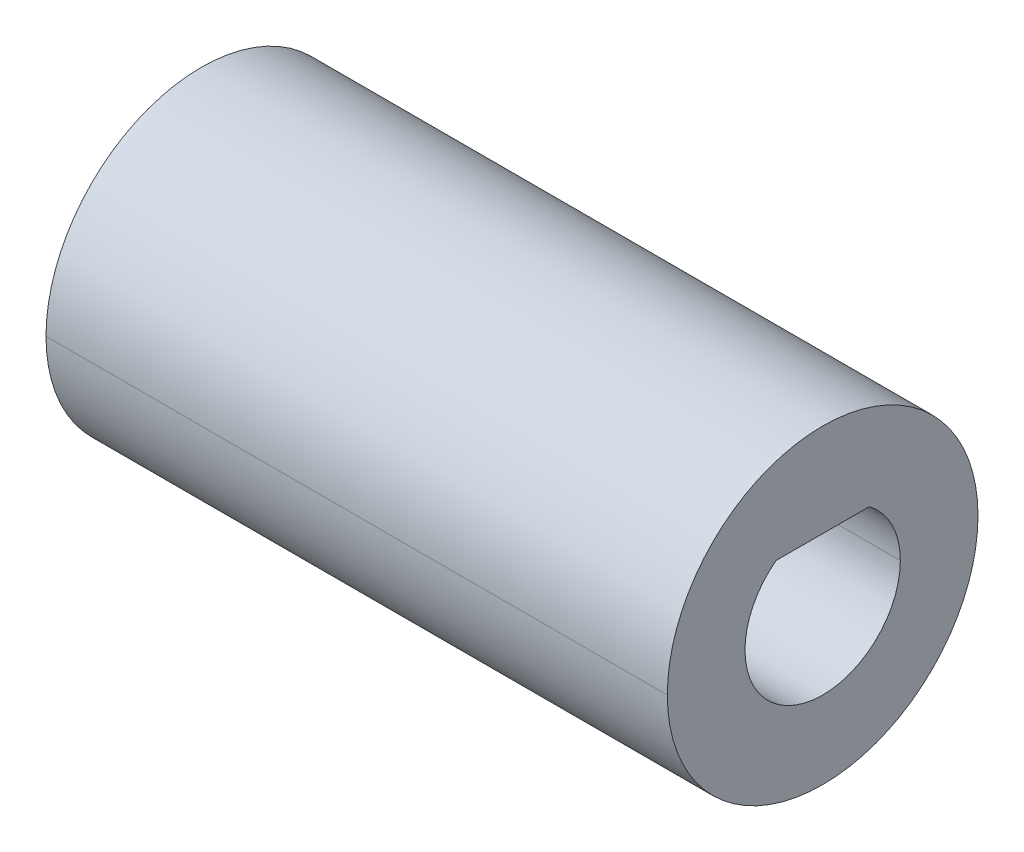
ISO-10303-21;
HEADER;
FILE_DESCRIPTION(('STEP AP214'),'2;1');
FILE_NAME('part.step','',(''),(''),'','','');
FILE_SCHEMA(('AUTOMOTIVE_DESIGN { 1 0 10303 214 1 1 1 1 }'));
ENDSEC;
DATA;
#1=APPLICATION_CONTEXT('core data for automotive mechanical design processes');
#2=APPLICATION_PROTOCOL_DEFINITION('international standard','automotive_design',2000,#1);
#3=PRODUCT_CONTEXT('',#1,'mechanical');
#4=PRODUCT('Part','Part','',(#3));
#5=PRODUCT_RELATED_PRODUCT_CATEGORY('part','',(#4));
#6=PRODUCT_DEFINITION_FORMATION('','',#4);
#7=PRODUCT_DEFINITION_CONTEXT('part definition',#1,'design');
#8=PRODUCT_DEFINITION('design','',#6,#7);
#9=PRODUCT_DEFINITION_SHAPE('','',#8);
#10=(LENGTH_UNIT() NAMED_UNIT(*) SI_UNIT(.MILLI.,.METRE.));
#11=(NAMED_UNIT(*) PLANE_ANGLE_UNIT() SI_UNIT($,.RADIAN.));
#12=(NAMED_UNIT(*) SI_UNIT($,.STERADIAN.) SOLID_ANGLE_UNIT());
#13=UNCERTAINTY_MEASURE_WITH_UNIT(LENGTH_MEASURE(1.E-05),#10,'distance_accuracy_value','');
#14=(GEOMETRIC_REPRESENTATION_CONTEXT(3) GLOBAL_UNCERTAINTY_ASSIGNED_CONTEXT((#13)) GLOBAL_UNIT_ASSIGNED_CONTEXT((#10,
#11,#12)) REPRESENTATION_CONTEXT('',''));
#15=CARTESIAN_POINT('',(0.,0.,0.));
#16=DIRECTION('',(0.,0.,1.));
#17=DIRECTION('',(1.,0.,0.));
#18=AXIS2_PLACEMENT_3D('',#15,#16,#17);
#19=CARTESIAN_POINT('',(20.,0.,10.));
#20=DIRECTION('',(-1.,0.,0.));
#21=DIRECTION('',(0.,0.,1.));
#22=AXIS2_PLACEMENT_3D('',#19,#20,#21);
#23=PLANE('',#22);
#24=DIRECTION('',(0.,0.,1.));
#25=VECTOR('',#24,1.);
#26=CARTESIAN_POINT('',(20.,7.,6.5));
#27=LINE('',#26,#25);
#28=CARTESIAN_POINT('',(20.,7.,3.5));
#29=VERTEX_POINT('',#28);
#30=CARTESIAN_POINT('',(20.,7.,6.5));
#31=VERTEX_POINT('',#30);
#32=EDGE_CURVE('E10',#29,#31,#27,.T.);
#33=ORIENTED_EDGE('',*,*,#32,.F.);
#34=CARTESIAN_POINT('',(20.,5.,5.));
#35=DIRECTION('',(1.,0.,0.));
#36=DIRECTION('',(0.,0.,-1.));
#37=AXIS2_PLACEMENT_3D('',#34,#35,#36);
#38=CIRCLE('',#37,2.5);
#39=CARTESIAN_POINT('',(20.,5.,2.5));
#40=VERTEX_POINT('',#39);
#41=EDGE_CURVE('E126',#40,#29,#38,.T.);
#42=ORIENTED_EDGE('',*,*,#41,.F.);
#43=CARTESIAN_POINT('',(20.,5.,5.));
#44=DIRECTION('',(1.,0.,0.));
#45=DIRECTION('',(0.,0.,-1.));
#46=AXIS2_PLACEMENT_3D('',#43,#44,#45);
#47=CIRCLE('',#46,2.5);
#48=CARTESIAN_POINT('',(20.,5.,7.5));
#49=VERTEX_POINT('',#48);
#50=EDGE_CURVE('E231',#49,#40,#47,.T.);
#51=ORIENTED_EDGE('',*,*,#50,.F.);
#52=CARTESIAN_POINT('',(20.,5.,5.));
#53=DIRECTION('',(1.,0.,0.));
#54=DIRECTION('',(0.,0.,-1.));
#55=AXIS2_PLACEMENT_3D('',#52,#53,#54);
#56=CIRCLE('',#55,2.5);
#57=EDGE_CURVE('E27',#31,#49,#56,.T.);
#58=ORIENTED_EDGE('',*,*,#57,.F.);
#59=EDGE_LOOP('',(#33,#42,#51,#58));
#60=FACE_BOUND('',#59,.T.);
#61=CARTESIAN_POINT('',(20.,5.,5.));
#62=DIRECTION('',(1.,0.,0.));
#63=DIRECTION('',(0.,0.,-1.));
#64=AXIS2_PLACEMENT_3D('',#61,#62,#63);
#65=CIRCLE('',#64,5.);
#66=CARTESIAN_POINT('',(20.,5.,0.));
#67=VERTEX_POINT('',#66);
#68=CARTESIAN_POINT('',(20.,5.,10.));
#69=VERTEX_POINT('',#68);
#70=EDGE_CURVE('E209',#67,#69,#65,.T.);
#71=ORIENTED_EDGE('',*,*,#70,.T.);
#72=CARTESIAN_POINT('',(20.,5.,5.));
#73=DIRECTION('',(1.,0.,0.));
#74=DIRECTION('',(0.,0.,-1.));
#75=AXIS2_PLACEMENT_3D('',#72,#73,#74);
#76=CIRCLE('',#75,5.);
#77=EDGE_CURVE('E95',#69,#67,#76,.T.);
#78=ORIENTED_EDGE('',*,*,#77,.T.);
#79=EDGE_LOOP('',(#71,#78));
#80=FACE_BOUND('',#79,.T.);
#81=ADVANCED_FACE('F16',(#60,#80),#23,.F.);
#82=CARTESIAN_POINT('',(12.,7.,6.5));
#83=DIRECTION('',(0.,1.,0.));
#84=DIRECTION('',(1.,0.,0.));
#85=AXIS2_PLACEMENT_3D('',#82,#83,#84);
#86=PLANE('',#85);
#87=ORIENTED_EDGE('',*,*,#32,.T.);
#88=DIRECTION('',(1.,0.,0.));
#89=VECTOR('',#88,1.);
#90=CARTESIAN_POINT('',(12.,7.,6.5));
#91=LINE('',#90,#89);
#92=CARTESIAN_POINT('',(12.,7.,6.5));
#93=VERTEX_POINT('',#92);
#94=EDGE_CURVE('E20',#93,#31,#91,.T.);
#95=ORIENTED_EDGE('',*,*,#94,.F.);
#96=DIRECTION('',(0.,0.,1.));
#97=VECTOR('',#96,1.);
#98=CARTESIAN_POINT('',(12.,7.,6.5));
#99=LINE('',#98,#97);
#100=CARTESIAN_POINT('',(12.,7.,3.5));
#101=VERTEX_POINT('',#100);
#102=EDGE_CURVE('E219',#101,#93,#99,.T.);
#103=ORIENTED_EDGE('',*,*,#102,.F.);
#104=DIRECTION('',(1.,0.,0.));
#105=VECTOR('',#104,1.);
#106=CARTESIAN_POINT('',(12.,7.,3.5));
#107=LINE('',#106,#105);
#108=EDGE_CURVE('E197',#101,#29,#107,.T.);
#109=ORIENTED_EDGE('',*,*,#108,.T.);
#110=EDGE_LOOP('',(#87,#95,#103,#109));
#111=FACE_BOUND('',#110,.T.);
#112=ADVANCED_FACE('F271',(#111),#86,.F.);
#113=CARTESIAN_POINT('',(12.,5.,5.));
#114=DIRECTION('',(1.,0.,0.));
#115=DIRECTION('',(0.,0.,-1.));
#116=AXIS2_PLACEMENT_3D('',#113,#114,#115);
#117=CYLINDRICAL_SURFACE('',#116,2.5);
#118=DIRECTION('',(1.,0.,0.));
#119=VECTOR('',#118,1.);
#120=CARTESIAN_POINT('',(12.,5.,7.5));
#121=LINE('',#120,#119);
#122=CARTESIAN_POINT('',(12.,5.,7.5));
#123=VERTEX_POINT('',#122);
#124=EDGE_CURVE('E240',#123,#49,#121,.T.);
#125=ORIENTED_EDGE('',*,*,#124,.F.);
#126=CARTESIAN_POINT('',(12.,5.,5.));
#127=DIRECTION('',(1.,0.,0.));
#128=DIRECTION('',(0.,0.,-1.));
#129=AXIS2_PLACEMENT_3D('',#126,#127,#128);
#130=CIRCLE('',#129,2.5);
#131=EDGE_CURVE('E223',#93,#123,#130,.T.);
#132=ORIENTED_EDGE('',*,*,#131,.F.);
#133=ORIENTED_EDGE('',*,*,#94,.T.);
#134=ORIENTED_EDGE('',*,*,#57,.T.);
#135=EDGE_LOOP('',(#125,#132,#133,#134));
#136=FACE_BOUND('',#135,.T.);
#137=ADVANCED_FACE('F277',(#136),#117,.F.);
#138=CARTESIAN_POINT('',(12.,5.,5.));
#139=DIRECTION('',(1.,0.,0.));
#140=DIRECTION('',(0.,1.,0.));
#141=AXIS2_PLACEMENT_3D('',#138,#139,#140);
#142=PLANE('',#141);
#143=ORIENTED_EDGE('',*,*,#131,.T.);
#144=CARTESIAN_POINT('',(12.,5.,5.));
#145=DIRECTION('',(1.,0.,0.));
#146=DIRECTION('',(0.,0.,-1.));
#147=AXIS2_PLACEMENT_3D('',#144,#145,#146);
#148=CIRCLE('',#147,2.5);
#149=CARTESIAN_POINT('',(12.,5.,2.5));
#150=VERTEX_POINT('',#149);
#151=EDGE_CURVE('E243',#123,#150,#148,.T.);
#152=ORIENTED_EDGE('',*,*,#151,.T.);
#153=CARTESIAN_POINT('',(12.,5.,5.));
#154=DIRECTION('',(1.,0.,0.));
#155=DIRECTION('',(0.,0.,-1.));
#156=AXIS2_PLACEMENT_3D('',#153,#154,#155);
#157=CIRCLE('',#156,2.5);
#158=EDGE_CURVE('E143',#150,#101,#157,.T.);
#159=ORIENTED_EDGE('',*,*,#158,.T.);
#160=ORIENTED_EDGE('',*,*,#102,.T.);
#161=EDGE_LOOP('',(#143,#152,#159,#160));
#162=FACE_BOUND('',#161,.T.);
#163=ADVANCED_FACE('F296',(#162),#142,.T.);
#164=CARTESIAN_POINT('',(0.,5.,5.));
#165=DIRECTION('',(1.,0.,0.));
#166=DIRECTION('',(0.,0.,-1.));
#167=AXIS2_PLACEMENT_3D('',#164,#165,#166);
#168=CYLINDRICAL_SURFACE('',#167,5.);
#169=DIRECTION('',(1.,0.,0.));
#170=VECTOR('',#169,1.);
#171=CARTESIAN_POINT('',(0.,5.,10.));
#172=LINE('',#171,#170);
#173=CARTESIAN_POINT('',(0.,5.,10.));
#174=VERTEX_POINT('',#173);
#175=EDGE_CURVE('E205',#174,#69,#172,.T.);
#176=ORIENTED_EDGE('',*,*,#175,.F.);
#177=CARTESIAN_POINT('',(0.,5.,5.));
#178=DIRECTION('',(1.,0.,0.));
#179=DIRECTION('',(0.,0.,-1.));
#180=AXIS2_PLACEMENT_3D('',#177,#178,#179);
#181=CIRCLE('',#180,5.);
#182=CARTESIAN_POINT('',(0.,5.,0.));
#183=VERTEX_POINT('',#182);
#184=EDGE_CURVE('E215',#174,#183,#181,.T.);
#185=ORIENTED_EDGE('',*,*,#184,.T.);
#186=DIRECTION('',(1.,0.,0.));
#187=VECTOR('',#186,1.);
#188=CARTESIAN_POINT('',(0.,5.,0.));
#189=LINE('',#188,#187);
#190=EDGE_CURVE('E218',#183,#67,#189,.T.);
#191=ORIENTED_EDGE('',*,*,#190,.T.);
#192=ORIENTED_EDGE('',*,*,#77,.F.);
#193=EDGE_LOOP('',(#176,#185,#191,#192));
#194=FACE_BOUND('',#193,.T.);
#195=ADVANCED_FACE('F269',(#194),#168,.T.);
#196=CARTESIAN_POINT('',(8.,5.,5.));
#197=DIRECTION('',(-1.,0.,0.));
#198=DIRECTION('',(0.,0.,1.));
#199=AXIS2_PLACEMENT_3D('',#196,#197,#198);
#200=PLANE('',#199);
#201=CARTESIAN_POINT('',(8.,5.,5.));
#202=DIRECTION('',(-1.,0.,0.));
#203=DIRECTION('',(0.,0.,1.));
#204=AXIS2_PLACEMENT_3D('',#201,#202,#203);
#205=CIRCLE('',#204,3.);
#206=CARTESIAN_POINT('',(8.,5.65,7.92873692912149));
#207=VERTEX_POINT('',#206);
#208=CARTESIAN_POINT('',(8.,5.65,2.07126307087851));
#209=VERTEX_POINT('',#208);
#210=EDGE_CURVE('E196',#207,#209,#205,.T.);
#211=ORIENTED_EDGE('',*,*,#210,.T.);
#212=DIRECTION('',(0.,0.,1.));
#213=VECTOR('',#212,1.);
#214=CARTESIAN_POINT('',(8.,5.65,2.07126307087851));
#215=LINE('',#214,#213);
#216=EDGE_CURVE('E106',#209,#207,#215,.T.);
#217=ORIENTED_EDGE('',*,*,#216,.T.);
#218=EDGE_LOOP('',(#211,#217));
#219=FACE_BOUND('',#218,.T.);
#220=ADVANCED_FACE('F286',(#219),#200,.T.);
#221=CARTESIAN_POINT('',(8.,5.65,2.07126307087851));
#222=DIRECTION('',(0.,-1.,0.));
#223=DIRECTION('',(0.,0.,-1.));
#224=AXIS2_PLACEMENT_3D('',#221,#222,#223);
#225=PLANE('',#224);
#226=DIRECTION('',(0.,0.,1.));
#227=VECTOR('',#226,1.);
#228=CARTESIAN_POINT('',(0.,5.65,2.07126307087851));
#229=LINE('',#228,#227);
#230=CARTESIAN_POINT('',(0.,5.65,2.07126307087851));
#231=VERTEX_POINT('',#230);
#232=CARTESIAN_POINT('',(0.,5.65,7.92873692912149));
#233=VERTEX_POINT('',#232);
#234=EDGE_CURVE('E189',#231,#233,#229,.T.);
#235=ORIENTED_EDGE('',*,*,#234,.T.);
#236=DIRECTION('',(-1.,0.,0.));
#237=VECTOR('',#236,1.);
#238=CARTESIAN_POINT('',(8.,5.65,7.92873692912149));
#239=LINE('',#238,#237);
#240=EDGE_CURVE('E194',#207,#233,#239,.T.);
#241=ORIENTED_EDGE('',*,*,#240,.F.);
#242=ORIENTED_EDGE('',*,*,#216,.F.);
#243=DIRECTION('',(-1.,0.,0.));
#244=VECTOR('',#243,1.);
#245=CARTESIAN_POINT('',(8.,5.65,2.07126307087851));
#246=LINE('',#245,#244);
#247=EDGE_CURVE('E81',#209,#231,#246,.T.);
#248=ORIENTED_EDGE('',*,*,#247,.T.);
#249=EDGE_LOOP('',(#235,#241,#242,#248));
#250=FACE_BOUND('',#249,.T.);
#251=ADVANCED_FACE('F284',(#250),#225,.F.);
#252=CARTESIAN_POINT('',(8.,5.,5.));
#253=DIRECTION('',(-1.,0.,0.));
#254=DIRECTION('',(0.,0.,1.));
#255=AXIS2_PLACEMENT_3D('',#252,#253,#254);
#256=CYLINDRICAL_SURFACE('',#255,3.);
#257=CARTESIAN_POINT('',(0.,5.,5.));
#258=DIRECTION('',(-1.,0.,0.));
#259=DIRECTION('',(0.,0.,1.));
#260=AXIS2_PLACEMENT_3D('',#257,#258,#259);
#261=CIRCLE('',#260,3.);
#262=EDGE_CURVE('E182',#233,#231,#261,.T.);
#263=ORIENTED_EDGE('',*,*,#262,.T.);
#264=ORIENTED_EDGE('',*,*,#247,.F.);
#265=ORIENTED_EDGE('',*,*,#210,.F.);
#266=ORIENTED_EDGE('',*,*,#240,.T.);
#267=EDGE_LOOP('',(#263,#264,#265,#266));
#268=FACE_BOUND('',#267,.T.);
#269=ADVANCED_FACE('F280',(#268),#256,.F.);
#270=CARTESIAN_POINT('',(8.,5.,5.));
#271=DIRECTION('',(-1.,0.,0.));
#272=DIRECTION('',(0.,0.,1.));
#273=AXIS2_PLACEMENT_3D('',#270,#271,#272);
#274=PLANE('',#273);
#275=CARTESIAN_POINT('',(8.,5.,5.));
#276=DIRECTION('',(-1.,0.,0.));
#277=DIRECTION('',(0.,0.,1.));
#278=AXIS2_PLACEMENT_3D('',#275,#276,#277);
#279=CIRCLE('',#278,3.);
#280=CARTESIAN_POINT('',(8.,4.35,2.07126307087851));
#281=VERTEX_POINT('',#280);
#282=CARTESIAN_POINT('',(8.,4.35,7.92873692912149));
#283=VERTEX_POINT('',#282);
#284=EDGE_CURVE('E172',#281,#283,#279,.T.);
#285=ORIENTED_EDGE('',*,*,#284,.T.);
#286=DIRECTION('',(0.,0.,-1.));
#287=VECTOR('',#286,1.);
#288=CARTESIAN_POINT('',(8.,4.35,2.07126307087851));
#289=LINE('',#288,#287);
#290=EDGE_CURVE('E152',#283,#281,#289,.T.);
#291=ORIENTED_EDGE('',*,*,#290,.T.);
#292=EDGE_LOOP('',(#285,#291));
#293=FACE_BOUND('',#292,.T.);
#294=ADVANCED_FACE('F283',(#293),#274,.T.);
#295=CARTESIAN_POINT('',(8.,4.35,2.07126307087851));
#296=DIRECTION('',(0.,1.,0.));
#297=DIRECTION('',(0.,0.,-1.));
#298=AXIS2_PLACEMENT_3D('',#295,#296,#297);
#299=PLANE('',#298);
#300=DIRECTION('',(0.,0.,-1.));
#301=VECTOR('',#300,1.);
#302=CARTESIAN_POINT('',(0.,4.35,2.07126307087851));
#303=LINE('',#302,#301);
#304=CARTESIAN_POINT('',(0.,4.35,7.92873692912149));
#305=VERTEX_POINT('',#304);
#306=CARTESIAN_POINT('',(0.,4.35,2.07126307087851));
#307=VERTEX_POINT('',#306);
#308=EDGE_CURVE('E170',#305,#307,#303,.T.);
#309=ORIENTED_EDGE('',*,*,#308,.T.);
#310=DIRECTION('',(-1.,0.,0.));
#311=VECTOR('',#310,1.);
#312=CARTESIAN_POINT('',(8.,4.35,2.07126307087851));
#313=LINE('',#312,#311);
#314=EDGE_CURVE('E161',#281,#307,#313,.T.);
#315=ORIENTED_EDGE('',*,*,#314,.F.);
#316=ORIENTED_EDGE('',*,*,#290,.F.);
#317=DIRECTION('',(-1.,0.,0.));
#318=VECTOR('',#317,1.);
#319=CARTESIAN_POINT('',(8.,4.35,7.92873692912149));
#320=LINE('',#319,#318);
#321=EDGE_CURVE('E167',#283,#305,#320,.T.);
#322=ORIENTED_EDGE('',*,*,#321,.T.);
#323=EDGE_LOOP('',(#309,#315,#316,#322));
#324=FACE_BOUND('',#323,.T.);
#325=ADVANCED_FACE('F168',(#324),#299,.F.);
#326=CARTESIAN_POINT('',(8.,5.,5.));
#327=DIRECTION('',(-1.,0.,0.));
#328=DIRECTION('',(0.,0.,1.));
#329=AXIS2_PLACEMENT_3D('',#326,#327,#328);
#330=CYLINDRICAL_SURFACE('',#329,3.);
#331=CARTESIAN_POINT('',(0.,5.,5.));
#332=DIRECTION('',(-1.,0.,0.));
#333=DIRECTION('',(0.,0.,1.));
#334=AXIS2_PLACEMENT_3D('',#331,#332,#333);
#335=CIRCLE('',#334,3.);
#336=EDGE_CURVE('E173',#307,#305,#335,.T.);
#337=ORIENTED_EDGE('',*,*,#336,.T.);
#338=ORIENTED_EDGE('',*,*,#321,.F.);
#339=ORIENTED_EDGE('',*,*,#284,.F.);
#340=ORIENTED_EDGE('',*,*,#314,.T.);
#341=EDGE_LOOP('',(#337,#338,#339,#340));
#342=FACE_BOUND('',#341,.T.);
#343=ADVANCED_FACE('F175',(#342),#330,.F.);
#344=CARTESIAN_POINT('',(0.,0.,10.));
#345=DIRECTION('',(1.,0.,0.));
#346=DIRECTION('',(0.,1.,0.));
#347=AXIS2_PLACEMENT_3D('',#344,#345,#346);
#348=PLANE('',#347);
#349=ORIENTED_EDGE('',*,*,#308,.F.);
#350=ORIENTED_EDGE('',*,*,#336,.F.);
#351=EDGE_LOOP('',(#349,#350));
#352=FACE_BOUND('',#351,.T.);
#353=ORIENTED_EDGE('',*,*,#234,.F.);
#354=ORIENTED_EDGE('',*,*,#262,.F.);
#355=EDGE_LOOP('',(#353,#354));
#356=FACE_BOUND('',#355,.T.);
#357=CARTESIAN_POINT('',(0.,5.,5.));
#358=DIRECTION('',(1.,0.,0.));
#359=DIRECTION('',(0.,0.,-1.));
#360=AXIS2_PLACEMENT_3D('',#357,#358,#359);
#361=CIRCLE('',#360,5.);
#362=EDGE_CURVE('E200',#183,#174,#361,.T.);
#363=ORIENTED_EDGE('',*,*,#362,.F.);
#364=ORIENTED_EDGE('',*,*,#184,.F.);
#365=EDGE_LOOP('',(#363,#364));
#366=FACE_BOUND('',#365,.T.);
#367=ADVANCED_FACE('F179',(#352,#356,#366),#348,.F.);
#368=CARTESIAN_POINT('',(0.,5.,5.));
#369=DIRECTION('',(1.,0.,0.));
#370=DIRECTION('',(0.,0.,-1.));
#371=AXIS2_PLACEMENT_3D('',#368,#369,#370);
#372=CYLINDRICAL_SURFACE('',#371,5.);
#373=ORIENTED_EDGE('',*,*,#362,.T.);
#374=ORIENTED_EDGE('',*,*,#175,.T.);
#375=ORIENTED_EDGE('',*,*,#70,.F.);
#376=ORIENTED_EDGE('',*,*,#190,.F.);
#377=EDGE_LOOP('',(#373,#374,#375,#376));
#378=FACE_BOUND('',#377,.T.);
#379=ADVANCED_FACE('F263',(#378),#372,.T.);
#380=CARTESIAN_POINT('',(12.,5.,5.));
#381=DIRECTION('',(1.,0.,0.));
#382=DIRECTION('',(0.,0.,-1.));
#383=AXIS2_PLACEMENT_3D('',#380,#381,#382);
#384=CYLINDRICAL_SURFACE('',#383,2.5);
#385=ORIENTED_EDGE('',*,*,#158,.F.);
#386=DIRECTION('',(1.,0.,0.));
#387=VECTOR('',#386,1.);
#388=CARTESIAN_POINT('',(12.,5.,2.5));
#389=LINE('',#388,#387);
#390=EDGE_CURVE('E212',#150,#40,#389,.T.);
#391=ORIENTED_EDGE('',*,*,#390,.T.);
#392=ORIENTED_EDGE('',*,*,#41,.T.);
#393=ORIENTED_EDGE('',*,*,#108,.F.);
#394=EDGE_LOOP('',(#385,#391,#392,#393));
#395=FACE_BOUND('',#394,.T.);
#396=ADVANCED_FACE('F289',(#395),#384,.F.);
#397=CARTESIAN_POINT('',(12.,5.,5.));
#398=DIRECTION('',(1.,0.,0.));
#399=DIRECTION('',(0.,0.,-1.));
#400=AXIS2_PLACEMENT_3D('',#397,#398,#399);
#401=CYLINDRICAL_SURFACE('',#400,2.5);
#402=ORIENTED_EDGE('',*,*,#151,.F.);
#403=ORIENTED_EDGE('',*,*,#124,.T.);
#404=ORIENTED_EDGE('',*,*,#50,.T.);
#405=ORIENTED_EDGE('',*,*,#390,.F.);
#406=EDGE_LOOP('',(#402,#403,#404,#405));
#407=FACE_BOUND('',#406,.T.);
#408=ADVANCED_FACE('F18',(#407),#401,.F.);
#409=CLOSED_SHELL('',(#81,#112,#137,#163,#195,#220,#251,#269,#294,#325,#343,#367,#379,#396,#408));
#410=MANIFOLD_SOLID_BREP('B1',#409);
#411=ADVANCED_BREP_SHAPE_REPRESENTATION('',(#18,#410),#14);
#412=SHAPE_DEFINITION_REPRESENTATION(#9,#411);
ENDSEC;
END-ISO-10303-21;
